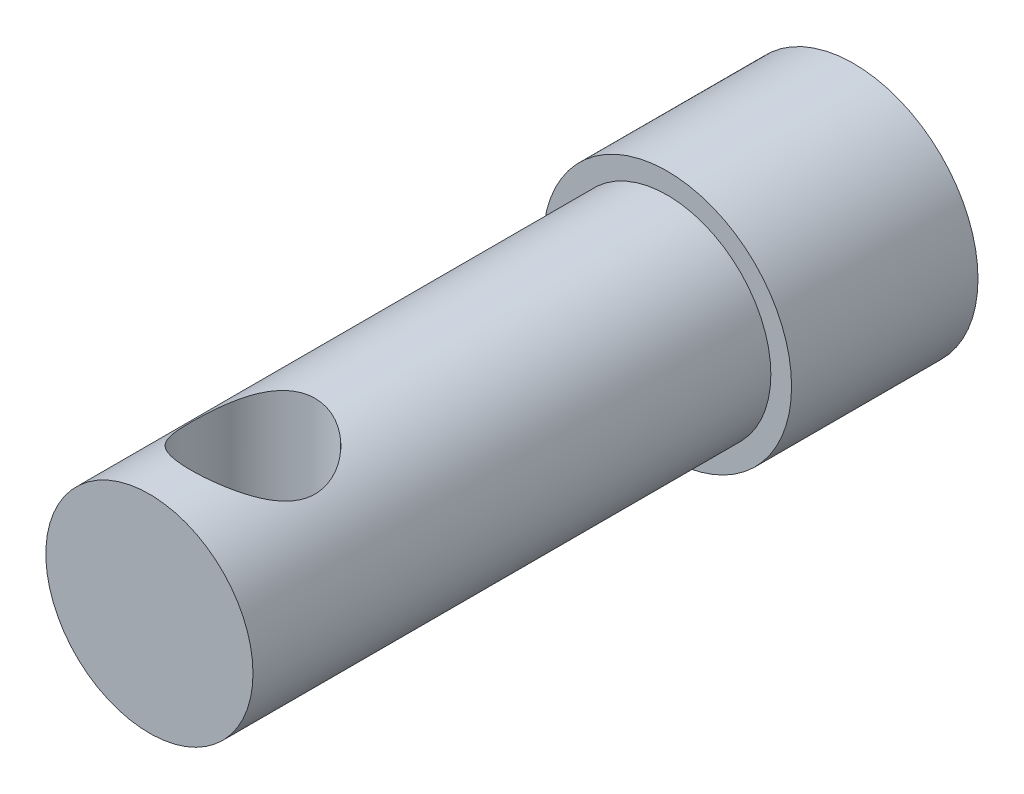
ISO-10303-21;
HEADER;
FILE_DESCRIPTION(('STEP AP214'),'2;1');
FILE_NAME('part.step','',(''),(''),'','','');
FILE_SCHEMA(('AUTOMOTIVE_DESIGN { 1 0 10303 214 1 1 1 1 }'));
ENDSEC;
DATA;
#1=APPLICATION_CONTEXT('core data for automotive mechanical design processes');
#2=APPLICATION_PROTOCOL_DEFINITION('international standard','automotive_design',2000,#1);
#3=PRODUCT_CONTEXT('',#1,'mechanical');
#4=PRODUCT('Part','Part','',(#3));
#5=PRODUCT_RELATED_PRODUCT_CATEGORY('part','',(#4));
#6=PRODUCT_DEFINITION_FORMATION('','',#4);
#7=PRODUCT_DEFINITION_CONTEXT('part definition',#1,'design');
#8=PRODUCT_DEFINITION('design','',#6,#7);
#9=PRODUCT_DEFINITION_SHAPE('','',#8);
#10=(LENGTH_UNIT() NAMED_UNIT(*) SI_UNIT(.MILLI.,.METRE.));
#11=(NAMED_UNIT(*) PLANE_ANGLE_UNIT() SI_UNIT($,.RADIAN.));
#12=(NAMED_UNIT(*) SI_UNIT($,.STERADIAN.) SOLID_ANGLE_UNIT());
#13=UNCERTAINTY_MEASURE_WITH_UNIT(LENGTH_MEASURE(1.E-05),#10,'distance_accuracy_value','');
#14=(GEOMETRIC_REPRESENTATION_CONTEXT(3) GLOBAL_UNCERTAINTY_ASSIGNED_CONTEXT((#13)) GLOBAL_UNIT_ASSIGNED_CONTEXT((#10,
#11,#12)) REPRESENTATION_CONTEXT('',''));
#15=CARTESIAN_POINT('',(0.,0.,0.));
#16=DIRECTION('',(0.,0.,1.));
#17=DIRECTION('',(1.,0.,0.));
#18=AXIS2_PLACEMENT_3D('',#15,#16,#17);
#19=CARTESIAN_POINT('',(0.,0.,34.));
#20=DIRECTION('',(0.,0.,-1.));
#21=DIRECTION('',(-1.,0.,0.));
#22=AXIS2_PLACEMENT_3D('',#19,#20,#21);
#23=CYLINDRICAL_SURFACE('',#22,5.);
#24=CARTESIAN_POINT('',(0.,5.,26.));
#25=CARTESIAN_POINT('',(0.0767697294351707,4.99999907546385,26.0000010562445));
#26=CARTESIAN_POINT('',(0.153562134518387,4.99822567812271,26.0029535935701));
#27=CARTESIAN_POINT('',(0.306548487758715,4.99118362570631,26.0147142329797));
#28=CARTESIAN_POINT('',(0.382742059346593,4.98591292553957,26.0235257611882));
#29=CARTESIAN_POINT('',(0.609808130024628,4.96499345352549,26.0586485594631));
#30=CARTESIAN_POINT('',(0.758981863291667,4.94423772571335,26.0936477024334));
#31=CARTESIAN_POINT('',(1.04754167363585,4.89123238995897,26.1847727435041));
#32=CARTESIAN_POINT('',(1.18697226741342,4.8590397955111,26.2407939220127));
#33=CARTESIAN_POINT('',(1.45405042800218,4.7859070225578,26.371720660597));
#34=CARTESIAN_POINT('',(1.58170090938261,4.74496901614699,26.4466215323602));
#35=CARTESIAN_POINT('',(1.83260160381823,4.65410731283371,26.6195496551151));
#36=CARTESIAN_POINT('',(1.95476885986166,4.60373587041895,26.7189073911665));
#37=CARTESIAN_POINT('',(2.1817645874806,4.50060875905921,26.9349344071922));
#38=CARTESIAN_POINT('',(2.28657046750404,4.4478500955754,27.0516258742183));
#39=CARTESIAN_POINT('',(2.48890019509838,4.33822134833335,27.3158470211689));
#40=CARTESIAN_POINT('',(2.5839553962784,4.28164035635797,27.4654035421222));
#41=CARTESIAN_POINT('',(2.74722868670786,4.17876602596121,27.7816931463269));
#42=CARTESIAN_POINT('',(2.8154903315581,4.13245604474886,27.9483977920332));
#43=CARTESIAN_POINT('',(2.90881204577224,4.06709259377223,28.2531929016569));
#44=CARTESIAN_POINT('',(2.94032394587637,4.04415766338645,28.3884719983614));
#45=CARTESIAN_POINT('',(2.98432344587083,4.01180616527621,28.6636074305214));
#46=CARTESIAN_POINT('',(2.99683469884359,4.00237279089368,28.803457853304));
#47=CARTESIAN_POINT('',(3.0021101681982,3.99841845126251,29.0840229926479));
#48=CARTESIAN_POINT('',(2.99483563630785,4.00392674756739,29.2247388659119));
#49=CARTESIAN_POINT('',(2.96092124146105,4.02906522155629,29.5025575351179));
#50=CARTESIAN_POINT('',(2.93426681225442,4.04870602134773,29.6396575329415));
#51=CARTESIAN_POINT('',(2.86347831933193,4.09906376582928,29.9050605422505));
#52=CARTESIAN_POINT('',(2.8195745342289,4.12963433300037,30.0334543229945));
#53=CARTESIAN_POINT('',(2.71590167467071,4.19854092703026,30.2813897666318));
#54=CARTESIAN_POINT('',(2.65612678414159,4.2368797994146,30.400928163829));
#55=CARTESIAN_POINT('',(2.5103577382067,4.32510698365561,30.6499691376563));
#56=CARTESIAN_POINT('',(2.42160671901867,4.3758426358075,30.7775599923677));
#57=CARTESIAN_POINT('',(2.22582963207776,4.4786102252415,31.0173491572201));
#58=CARTESIAN_POINT('',(2.11878609335504,4.53064336077653,31.1295325654021));
#59=CARTESIAN_POINT('',(1.87159040921357,4.63871766962913,31.3512422594485));
#60=CARTESIAN_POINT('',(1.72890315178768,4.69430681953073,31.4582193912373));
#61=CARTESIAN_POINT('',(1.50061053630278,4.77018325995047,31.5992687127229));
#62=CARTESIAN_POINT('',(1.42209821815681,4.79423315237467,31.6430641355161));
#63=CARTESIAN_POINT('',(1.26074368673913,4.83916496756429,31.723718823611));
#64=CARTESIAN_POINT('',(1.17790417501176,4.86004883588963,31.7605823520208));
#65=CARTESIAN_POINT('',(1.01376371174001,4.8968267274493,31.8248114428566));
#66=CARTESIAN_POINT('',(0.932690066663957,4.91295100454953,31.8526265604492));
#67=CARTESIAN_POINT('',(0.767879949732826,4.94139126794745,31.9013339558452));
#68=CARTESIAN_POINT('',(0.684144997174636,4.95370938553284,31.9222301084464));
#69=CARTESIAN_POINT('',(0.514744462654421,4.97416370514887,31.9567718547248));
#70=CARTESIAN_POINT('',(0.429080341969608,4.98230296820872,31.9704227558286));
#71=CARTESIAN_POINT('',(0.256621746592204,4.99415996414414,31.9902661843902));
#72=CARTESIAN_POINT('',(0.169827432617757,4.99787831889699,31.9964597608513));
#73=CARTESIAN_POINT('',(-0.067324257110645,5.00179157954795,32.0029926702836));
#74=CARTESIAN_POINT('',(-0.218056842610663,4.99746512571837,31.9958115456306));
#75=CARTESIAN_POINT('',(-0.515686907628998,4.97557955020067,31.9591544582709));
#76=CARTESIAN_POINT('',(-0.662584464852967,4.95802069684413,31.9296789476581));
#77=CARTESIAN_POINT('',(-0.945142599254814,4.91189447655688,31.8509115408157));
#78=CARTESIAN_POINT('',(-1.08098954856944,4.88360514429733,31.802118873408));
#79=CARTESIAN_POINT('',(-1.34253345184752,4.81827798628348,31.6866456757991));
#80=CARTESIAN_POINT('',(-1.46822839746276,4.78123843515362,31.6199616174059));
#81=CARTESIAN_POINT('',(-1.72001192130151,4.69690981059277,31.462885909022));
#82=CARTESIAN_POINT('',(-1.84478813824221,4.6489560240695,31.3707523061625));
#83=CARTESIAN_POINT('',(-2.07805222548222,4.54948534225871,31.1692172487452));
#84=CARTESIAN_POINT('',(-2.18652085154156,4.49796434043363,31.0597957003973));
#85=CARTESIAN_POINT('',(-2.39863988264158,4.38890846835682,30.8101792085068));
#86=CARTESIAN_POINT('',(-2.49982037884172,4.33146483230154,30.667832226057));
#87=CARTESIAN_POINT('',(-2.67690479207535,4.22432364395571,30.3655679538724));
#88=CARTESIAN_POINT('',(-2.75283533845462,4.1746179606141,30.2056694128488));
#89=CARTESIAN_POINT('',(-2.86285157351706,4.09969818429266,29.9075139548893));
#90=CARTESIAN_POINT('',(-2.90243250662613,4.07151318633887,29.772039375358));
#91=CARTESIAN_POINT('',(-2.96227327821697,4.02819211510624,29.4949358437648));
#92=CARTESIAN_POINT('',(-2.98255990395067,4.01303795327895,29.3533157105485));
#93=CARTESIAN_POINT('',(-3.00268261034206,3.99800893189922,29.0672461056048));
#94=CARTESIAN_POINT('',(-3.00244179030845,3.99819152744816,28.9227880217517));
#95=CARTESIAN_POINT('',(-2.98132945103105,4.01395435932838,28.6362111256536));
#96=CARTESIAN_POINT('',(-2.96044671369591,4.02954296823692,28.4940936281252));
#97=CARTESIAN_POINT('',(-2.90080351212233,4.07266369966216,28.2230231760049));
#98=CARTESIAN_POINT('',(-2.86295284328648,4.09958421715569,28.0937658520756));
#99=CARTESIAN_POINT('',(-2.77126473512031,4.16211005816609,27.8433254503469));
#100=CARTESIAN_POINT('',(-2.7174212751772,4.19771865147484,27.722145434387));
#101=CARTESIAN_POINT('',(-2.58578536859698,4.28025972950371,27.47136046054));
#102=CARTESIAN_POINT('',(-2.50558518231556,4.32809142579694,27.3433184917852));
#103=CARTESIAN_POINT('',(-2.32751213746958,4.42640286674054,27.1012391546934));
#104=CARTESIAN_POINT('',(-2.22962472612067,4.47688476749087,26.9872134495205));
#105=CARTESIAN_POINT('',(-2.00020353552556,4.5845123827036,26.7573011566705));
#106=CARTESIAN_POINT('',(-1.86578571790514,4.64140045738634,26.6441501201384));
#107=CARTESIAN_POINT('',(-1.57689277813436,4.74731429537958,26.4417920139519));
#108=CARTESIAN_POINT('',(-1.42241049573676,4.79633723789531,26.3525935270803));
#109=CARTESIAN_POINT('',(-1.18102189661686,4.85920558314903,26.2408755258095));
#110=CARTESIAN_POINT('',(-1.10025014285136,4.87817139185349,26.2076640040355));
#111=CARTESIAN_POINT('',(-0.935442217988387,4.91243413775203,26.1482278618565));
#112=CARTESIAN_POINT('',(-0.851407984788101,4.9277332153652,26.1219991642991));
#113=CARTESIAN_POINT('',(-0.681001816074567,4.95415527987996,26.0769905579243));
#114=CARTESIAN_POINT('',(-0.594637500609293,4.9652904423195,26.0581889226967));
#115=CARTESIAN_POINT('',(-0.420183746020764,4.98308318645253,26.028255644677));
#116=CARTESIAN_POINT('',(-0.332095806784398,4.98974449723791,26.0171176138467));
#117=CARTESIAN_POINT('',(-0.203123929661339,4.99603728421477,26.0066083161947));
#118=CARTESIAN_POINT('',(-0.16255628111349,4.99752198179196,26.004131569546));
#119=CARTESIAN_POINT('',(-0.0813278781867691,4.99950360169341,26.0008271030861));
#120=CARTESIAN_POINT('',(-0.0406671206271725,5.00000048975323,25.9999994404771));
#121=CARTESIAN_POINT('',(0.,5.,26.));
#122=B_SPLINE_CURVE_WITH_KNOTS('',3,(#24,#25,#26,#27,#28,#29,#30,#31,#32,#33,#34,#35,#36,#37,
#38,#39,#40,#41,#42,#43,#44,#45,#46,#47,#48,#49,#50,#51,#52,#53,#54,#55,#56,#57,#58,#59,#60,#61,
#62,#63,#64,#65,#66,#67,#68,#69,#70,#71,#72,#73,#74,#75,#76,#77,#78,#79,#80,#81,#82,#83,#84,#85,
#86,#87,#88,#89,#90,#91,#92,#93,#94,#95,#96,#97,#98,#99,#100,#101,#102,#103,#104,#105,#106,#107,
#108,#109,#110,#111,#112,#113,#114,#115,#116,#117,#118,#119,#120,#121),.UNSPECIFIED.,.T.,.F.,(4,
2,2,2,2,2,2,2,2,2,2,2,2,2,2,2,2,2,2,2,2,2,2,2,2,2,2,2,2,2,2,2,2,2,2,2,2,2,2,2,2,2,2,2,2,2,2,2,
4),(0.,0.230263300595003,0.4606613693334,0.922002149276126,1.38107466343613,1.84003329022065,
2.33408870888555,2.82878205293211,3.38413315803225,3.93857770807794,4.35913349134877,
4.77916531256766,5.20002031165062,5.62119195971355,6.03692224610024,6.45280509043347,
6.94139679873935,7.43045779030958,7.98767605192992,8.26653157143431,8.54521503013734,
8.80648473589063,9.06760787545943,9.32853946730961,9.58943435026958,10.0398406663534,
10.490237849174,10.9296843257003,11.3692175250854,11.8543559282721,12.3400624135416,
12.889063860465,13.437484464234,13.8674843581987,14.2968863865712,14.7278971274535,
15.1591422350194,15.5696105785277,15.9802336423656,16.4539008129506,16.927959499309,
17.4794148474152,18.0310675325446,18.2988384573895,18.5664526907294,18.8332781687618,
19.0998809626714,19.221853785686,19.3438308395353),.UNSPECIFIED.);
#123=CARTESIAN_POINT('',(0.,5.,26.));
#124=VERTEX_POINT('',#123);
#125=EDGE_CURVE('E38',#124,#124,#122,.T.);
#126=ORIENTED_EDGE('',*,*,#125,.T.);
#127=EDGE_LOOP('',(#126));
#128=FACE_BOUND('',#127,.T.);
#129=CARTESIAN_POINT('',(0.,-5.,26.));
#130=CARTESIAN_POINT('',(-0.0767697294351707,-4.99999907546385,26.0000010562445));
#131=CARTESIAN_POINT('',(-0.153562134518387,-4.99822567812271,26.0029535935701));
#132=CARTESIAN_POINT('',(-0.306548487758715,-4.99118362570631,26.0147142329797));
#133=CARTESIAN_POINT('',(-0.382742059346593,-4.98591292553957,26.0235257611882));
#134=CARTESIAN_POINT('',(-0.609808130024628,-4.96499345352549,26.0586485594631));
#135=CARTESIAN_POINT('',(-0.758981863291667,-4.94423772571335,26.0936477024334));
#136=CARTESIAN_POINT('',(-1.04754167363585,-4.89123238995897,26.1847727435041));
#137=CARTESIAN_POINT('',(-1.18697226741342,-4.8590397955111,26.2407939220127));
#138=CARTESIAN_POINT('',(-1.45405042800218,-4.7859070225578,26.371720660597));
#139=CARTESIAN_POINT('',(-1.58170090938261,-4.74496901614699,26.4466215323602));
#140=CARTESIAN_POINT('',(-1.83260160381823,-4.65410731283371,26.6195496551151));
#141=CARTESIAN_POINT('',(-1.95476885986166,-4.60373587041895,26.7189073911665));
#142=CARTESIAN_POINT('',(-2.1817645874806,-4.50060875905921,26.9349344071922));
#143=CARTESIAN_POINT('',(-2.28657046750404,-4.4478500955754,27.0516258742183));
#144=CARTESIAN_POINT('',(-2.48890019509838,-4.33822134833335,27.3158470211689));
#145=CARTESIAN_POINT('',(-2.5839553962784,-4.28164035635797,27.4654035421222));
#146=CARTESIAN_POINT('',(-2.74722868670786,-4.17876602596121,27.7816931463269));
#147=CARTESIAN_POINT('',(-2.8154903315581,-4.13245604474886,27.9483977920332));
#148=CARTESIAN_POINT('',(-2.90881204577224,-4.06709259377223,28.2531929016569));
#149=CARTESIAN_POINT('',(-2.94032394587637,-4.04415766338645,28.3884719983614));
#150=CARTESIAN_POINT('',(-2.98432344587083,-4.01180616527621,28.6636074305214));
#151=CARTESIAN_POINT('',(-2.99683469884359,-4.00237279089368,28.803457853304));
#152=CARTESIAN_POINT('',(-3.0021101681982,-3.99841845126251,29.0840229926479));
#153=CARTESIAN_POINT('',(-2.99483563630785,-4.00392674756739,29.2247388659119));
#154=CARTESIAN_POINT('',(-2.96092124146105,-4.02906522155629,29.5025575351179));
#155=CARTESIAN_POINT('',(-2.93426681225442,-4.04870602134773,29.6396575329415));
#156=CARTESIAN_POINT('',(-2.86347831933193,-4.09906376582928,29.9050605422505));
#157=CARTESIAN_POINT('',(-2.8195745342289,-4.12963433300037,30.0334543229945));
#158=CARTESIAN_POINT('',(-2.71590167467071,-4.19854092703026,30.2813897666318));
#159=CARTESIAN_POINT('',(-2.65612678414159,-4.2368797994146,30.400928163829));
#160=CARTESIAN_POINT('',(-2.5103577382067,-4.32510698365561,30.6499691376563));
#161=CARTESIAN_POINT('',(-2.42160671901867,-4.3758426358075,30.7775599923677));
#162=CARTESIAN_POINT('',(-2.22582963207776,-4.4786102252415,31.0173491572201));
#163=CARTESIAN_POINT('',(-2.11878609335504,-4.53064336077653,31.1295325654021));
#164=CARTESIAN_POINT('',(-1.87159040921357,-4.63871766962913,31.3512422594485));
#165=CARTESIAN_POINT('',(-1.72890315178768,-4.69430681953073,31.4582193912373));
#166=CARTESIAN_POINT('',(-1.50061053630278,-4.77018325995047,31.5992687127229));
#167=CARTESIAN_POINT('',(-1.42209821815681,-4.79423315237467,31.6430641355161));
#168=CARTESIAN_POINT('',(-1.26074368673913,-4.83916496756429,31.723718823611));
#169=CARTESIAN_POINT('',(-1.17790417501176,-4.86004883588963,31.7605823520208));
#170=CARTESIAN_POINT('',(-1.01376371174001,-4.8968267274493,31.8248114428566));
#171=CARTESIAN_POINT('',(-0.932690066663957,-4.91295100454953,31.8526265604492));
#172=CARTESIAN_POINT('',(-0.767879949732826,-4.94139126794745,31.9013339558452));
#173=CARTESIAN_POINT('',(-0.684144997174636,-4.95370938553284,31.9222301084464));
#174=CARTESIAN_POINT('',(-0.514744462654421,-4.97416370514887,31.9567718547248));
#175=CARTESIAN_POINT('',(-0.429080341969608,-4.98230296820872,31.9704227558286));
#176=CARTESIAN_POINT('',(-0.256621746592204,-4.99415996414414,31.9902661843902));
#177=CARTESIAN_POINT('',(-0.169827432617757,-4.99787831889699,31.9964597608513));
#178=CARTESIAN_POINT('',(0.067324257110645,-5.00179157954795,32.0029926702836));
#179=CARTESIAN_POINT('',(0.218056842610663,-4.99746512571837,31.9958115456306));
#180=CARTESIAN_POINT('',(0.515686907628998,-4.97557955020067,31.9591544582709));
#181=CARTESIAN_POINT('',(0.662584464852967,-4.95802069684413,31.9296789476581));
#182=CARTESIAN_POINT('',(0.945142599254814,-4.91189447655688,31.8509115408157));
#183=CARTESIAN_POINT('',(1.08098954856944,-4.88360514429733,31.802118873408));
#184=CARTESIAN_POINT('',(1.34253345184752,-4.81827798628348,31.6866456757991));
#185=CARTESIAN_POINT('',(1.46822839746276,-4.78123843515362,31.6199616174059));
#186=CARTESIAN_POINT('',(1.72001192130151,-4.69690981059277,31.462885909022));
#187=CARTESIAN_POINT('',(1.84478813824221,-4.6489560240695,31.3707523061625));
#188=CARTESIAN_POINT('',(2.07805222548222,-4.54948534225871,31.1692172487452));
#189=CARTESIAN_POINT('',(2.18652085154156,-4.49796434043363,31.0597957003973));
#190=CARTESIAN_POINT('',(2.39863988264158,-4.38890846835682,30.8101792085068));
#191=CARTESIAN_POINT('',(2.49982037884172,-4.33146483230154,30.667832226057));
#192=CARTESIAN_POINT('',(2.67690479207535,-4.22432364395571,30.3655679538724));
#193=CARTESIAN_POINT('',(2.75283533845462,-4.1746179606141,30.2056694128488));
#194=CARTESIAN_POINT('',(2.86285157351706,-4.09969818429266,29.9075139548893));
#195=CARTESIAN_POINT('',(2.90243250662613,-4.07151318633887,29.772039375358));
#196=CARTESIAN_POINT('',(2.96227327821697,-4.02819211510624,29.4949358437648));
#197=CARTESIAN_POINT('',(2.98255990395067,-4.01303795327895,29.3533157105485));
#198=CARTESIAN_POINT('',(3.00268261034206,-3.99800893189922,29.0672461056048));
#199=CARTESIAN_POINT('',(3.00244179030845,-3.99819152744816,28.9227880217517));
#200=CARTESIAN_POINT('',(2.98132945103105,-4.01395435932838,28.6362111256536));
#201=CARTESIAN_POINT('',(2.96044671369591,-4.02954296823692,28.4940936281252));
#202=CARTESIAN_POINT('',(2.90080351212233,-4.07266369966216,28.2230231760049));
#203=CARTESIAN_POINT('',(2.86295284328648,-4.09958421715569,28.0937658520756));
#204=CARTESIAN_POINT('',(2.77126473512031,-4.16211005816609,27.8433254503469));
#205=CARTESIAN_POINT('',(2.7174212751772,-4.19771865147484,27.722145434387));
#206=CARTESIAN_POINT('',(2.58578536859698,-4.28025972950371,27.47136046054));
#207=CARTESIAN_POINT('',(2.50558518231556,-4.32809142579694,27.3433184917852));
#208=CARTESIAN_POINT('',(2.32751213746958,-4.42640286674054,27.1012391546934));
#209=CARTESIAN_POINT('',(2.22962472612067,-4.47688476749087,26.9872134495205));
#210=CARTESIAN_POINT('',(2.00020353552556,-4.5845123827036,26.7573011566705));
#211=CARTESIAN_POINT('',(1.86578571790514,-4.64140045738634,26.6441501201384));
#212=CARTESIAN_POINT('',(1.57689277813436,-4.74731429537958,26.4417920139519));
#213=CARTESIAN_POINT('',(1.42241049573676,-4.79633723789531,26.3525935270803));
#214=CARTESIAN_POINT('',(1.18102189661686,-4.85920558314903,26.2408755258095));
#215=CARTESIAN_POINT('',(1.10025014285136,-4.87817139185349,26.2076640040355));
#216=CARTESIAN_POINT('',(0.935442217988387,-4.91243413775203,26.1482278618565));
#217=CARTESIAN_POINT('',(0.851407984788101,-4.9277332153652,26.1219991642991));
#218=CARTESIAN_POINT('',(0.681001816074567,-4.95415527987996,26.0769905579243));
#219=CARTESIAN_POINT('',(0.594637500609293,-4.9652904423195,26.0581889226967));
#220=CARTESIAN_POINT('',(0.420183746020764,-4.98308318645253,26.028255644677));
#221=CARTESIAN_POINT('',(0.332095806784398,-4.98974449723791,26.0171176138467));
#222=CARTESIAN_POINT('',(0.203123929661339,-4.99603728421477,26.0066083161947));
#223=CARTESIAN_POINT('',(0.16255628111349,-4.99752198179196,26.004131569546));
#224=CARTESIAN_POINT('',(0.0813278781867691,-4.99950360169341,26.0008271030861));
#225=CARTESIAN_POINT('',(0.0406671206271725,-5.00000048975323,25.9999994404771));
#226=CARTESIAN_POINT('',(0.,-5.,26.));
#227=B_SPLINE_CURVE_WITH_KNOTS('',3,(#129,#130,#131,#132,#133,#134,#135,#136,#137,#138,#139,
#140,#141,#142,#143,#144,#145,#146,#147,#148,#149,#150,#151,#152,#153,#154,#155,#156,#157,#158,
#159,#160,#161,#162,#163,#164,#165,#166,#167,#168,#169,#170,#171,#172,#173,#174,#175,#176,#177,
#178,#179,#180,#181,#182,#183,#184,#185,#186,#187,#188,#189,#190,#191,#192,#193,#194,#195,#196,
#197,#198,#199,#200,#201,#202,#203,#204,#205,#206,#207,#208,#209,#210,#211,#212,#213,#214,#215,
#216,#217,#218,#219,#220,#221,#222,#223,#224,#225,#226),.UNSPECIFIED.,.T.,.F.,(4,2,2,2,2,2,2,2,
2,2,2,2,2,2,2,2,2,2,2,2,2,2,2,2,2,2,2,2,2,2,2,2,2,2,2,2,2,2,2,2,2,2,2,2,2,2,2,2,4),(0.,
0.230263300595003,0.4606613693334,0.922002149276126,1.38107466343613,1.84003329022065,
2.33408870888555,2.82878205293211,3.38413315803225,3.93857770807794,4.35913349134877,
4.77916531256766,5.20002031165062,5.62119195971355,6.03692224610024,6.45280509043347,
6.94139679873935,7.43045779030958,7.98767605192992,8.26653157143431,8.54521503013734,
8.80648473589063,9.06760787545943,9.32853946730961,9.58943435026958,10.0398406663534,
10.490237849174,10.9296843257003,11.3692175250854,11.8543559282721,12.3400624135416,
12.889063860465,13.437484464234,13.8674843581987,14.2968863865712,14.7278971274535,
15.1591422350194,15.5696105785277,15.9802336423656,16.4539008129506,16.927959499309,
17.4794148474152,18.0310675325446,18.2988384573895,18.5664526907294,18.8332781687618,
19.0998809626714,19.221853785686,19.3438308395353),.UNSPECIFIED.);
#228=CARTESIAN_POINT('',(0.,-5.,26.));
#229=VERTEX_POINT('',#228);
#230=EDGE_CURVE('E11',#229,#229,#227,.T.);
#231=ORIENTED_EDGE('',*,*,#230,.T.);
#232=EDGE_LOOP('',(#231));
#233=FACE_BOUND('',#232,.T.);
#234=CARTESIAN_POINT('',(0.,0.,9.));
#235=DIRECTION('',(0.,0.,1.));
#236=DIRECTION('',(1.,0.,0.));
#237=AXIS2_PLACEMENT_3D('',#234,#235,#236);
#238=CIRCLE('',#237,5.);
#239=CARTESIAN_POINT('',(5.,0.,9.));
#240=VERTEX_POINT('',#239);
#241=EDGE_CURVE('E171',#240,#240,#238,.T.);
#242=ORIENTED_EDGE('',*,*,#241,.T.);
#243=EDGE_LOOP('',(#242));
#244=FACE_BOUND('',#243,.T.);
#245=CARTESIAN_POINT('',(0.,0.,34.));
#246=DIRECTION('',(0.,0.,1.));
#247=DIRECTION('',(1.,0.,0.));
#248=AXIS2_PLACEMENT_3D('',#245,#246,#247);
#249=CIRCLE('',#248,5.);
#250=CARTESIAN_POINT('',(5.,0.,34.));
#251=VERTEX_POINT('',#250);
#252=EDGE_CURVE('E46',#251,#251,#249,.T.);
#253=ORIENTED_EDGE('',*,*,#252,.F.);
#254=EDGE_LOOP('',(#253));
#255=FACE_BOUND('',#254,.T.);
#256=ADVANCED_FACE('F34',(#128,#233,#244,#255),#23,.T.);
#257=CARTESIAN_POINT('',(0.,0.,34.));
#258=DIRECTION('',(0.,0.,1.));
#259=DIRECTION('',(1.,0.,0.));
#260=AXIS2_PLACEMENT_3D('',#257,#258,#259);
#261=PLANE('',#260);
#262=ORIENTED_EDGE('',*,*,#252,.T.);
#263=EDGE_LOOP('',(#262));
#264=FACE_BOUND('',#263,.T.);
#265=ADVANCED_FACE('F218',(#264),#261,.T.);
#266=CARTESIAN_POINT('',(0.,0.,9.));
#267=DIRECTION('',(0.,0.,1.));
#268=DIRECTION('',(1.,0.,0.));
#269=AXIS2_PLACEMENT_3D('',#266,#267,#268);
#270=PLANE('',#269);
#271=CARTESIAN_POINT('',(0.,0.,9.));
#272=DIRECTION('',(0.,0.,1.));
#273=DIRECTION('',(1.,0.,0.));
#274=AXIS2_PLACEMENT_3D('',#271,#272,#273);
#275=CIRCLE('',#274,6.);
#276=CARTESIAN_POINT('',(6.,0.,9.));
#277=VERTEX_POINT('',#276);
#278=EDGE_CURVE('E168',#277,#277,#275,.T.);
#279=ORIENTED_EDGE('',*,*,#278,.T.);
#280=EDGE_LOOP('',(#279));
#281=FACE_BOUND('',#280,.T.);
#282=ORIENTED_EDGE('',*,*,#241,.F.);
#283=EDGE_LOOP('',(#282));
#284=FACE_BOUND('',#283,.T.);
#285=ADVANCED_FACE('F214',(#281,#284),#270,.T.);
#286=CARTESIAN_POINT('',(0.,0.,9.));
#287=DIRECTION('',(0.,0.,-1.));
#288=DIRECTION('',(-1.,0.,0.));
#289=AXIS2_PLACEMENT_3D('',#286,#287,#288);
#290=CYLINDRICAL_SURFACE('',#289,6.);
#291=ORIENTED_EDGE('',*,*,#278,.F.);
#292=EDGE_LOOP('',(#291));
#293=FACE_BOUND('',#292,.T.);
#294=CARTESIAN_POINT('',(0.,0.,0.));
#295=DIRECTION('',(0.,0.,1.));
#296=DIRECTION('',(1.,0.,0.));
#297=AXIS2_PLACEMENT_3D('',#294,#295,#296);
#298=CIRCLE('',#297,6.);
#299=CARTESIAN_POINT('',(6.,0.,0.));
#300=VERTEX_POINT('',#299);
#301=EDGE_CURVE('E158',#300,#300,#298,.T.);
#302=ORIENTED_EDGE('',*,*,#301,.T.);
#303=EDGE_LOOP('',(#302));
#304=FACE_BOUND('',#303,.T.);
#305=ADVANCED_FACE('F217',(#293,#304),#290,.T.);
#306=CARTESIAN_POINT('',(0.,0.,0.));
#307=DIRECTION('',(0.,0.,1.));
#308=DIRECTION('',(1.,0.,0.));
#309=AXIS2_PLACEMENT_3D('',#306,#307,#308);
#310=PLANE('',#309);
#311=DIRECTION('',(0.,1.,0.));
#312=VECTOR('',#311,1.);
#313=CARTESIAN_POINT('',(-3.165,-2.565,0.));
#314=LINE('',#313,#312);
#315=CARTESIAN_POINT('',(-3.165,-2.565,0.));
#316=VERTEX_POINT('',#315);
#317=CARTESIAN_POINT('',(-3.165,2.565,0.));
#318=VERTEX_POINT('',#317);
#319=EDGE_CURVE('E139',#316,#318,#314,.T.);
#320=ORIENTED_EDGE('',*,*,#319,.F.);
#321=CARTESIAN_POINT('',(-2.565,-2.565,0.));
#322=DIRECTION('',(0.,0.,-1.));
#323=DIRECTION('',(-1.,0.,0.));
#324=AXIS2_PLACEMENT_3D('',#321,#322,#323);
#325=CIRCLE('',#324,0.6);
#326=CARTESIAN_POINT('',(-2.565,-3.165,0.));
#327=VERTEX_POINT('',#326);
#328=EDGE_CURVE('E53',#327,#316,#325,.T.);
#329=ORIENTED_EDGE('',*,*,#328,.F.);
#330=DIRECTION('',(-1.,0.,0.));
#331=VECTOR('',#330,1.);
#332=CARTESIAN_POINT('',(-2.565,-3.165,0.));
#333=LINE('',#332,#331);
#334=CARTESIAN_POINT('',(2.565,-3.165,0.));
#335=VERTEX_POINT('',#334);
#336=EDGE_CURVE('E154',#335,#327,#333,.T.);
#337=ORIENTED_EDGE('',*,*,#336,.F.);
#338=CARTESIAN_POINT('',(2.565,-2.565,0.));
#339=DIRECTION('',(0.,0.,-1.));
#340=DIRECTION('',(1.,0.,0.));
#341=AXIS2_PLACEMENT_3D('',#338,#339,#340);
#342=CIRCLE('',#341,0.6);
#343=CARTESIAN_POINT('',(3.165,-2.565,0.));
#344=VERTEX_POINT('',#343);
#345=EDGE_CURVE('E152',#344,#335,#342,.T.);
#346=ORIENTED_EDGE('',*,*,#345,.F.);
#347=DIRECTION('',(0.,-1.,0.));
#348=VECTOR('',#347,1.);
#349=CARTESIAN_POINT('',(3.165,-2.565,0.));
#350=LINE('',#349,#348);
#351=CARTESIAN_POINT('',(3.165,2.56499999999999,0.));
#352=VERTEX_POINT('',#351);
#353=EDGE_CURVE('E113',#352,#344,#350,.T.);
#354=ORIENTED_EDGE('',*,*,#353,.F.);
#355=CARTESIAN_POINT('',(2.565,2.565,0.));
#356=DIRECTION('',(0.,0.,-1.));
#357=DIRECTION('',(-1.,0.,0.));
#358=AXIS2_PLACEMENT_3D('',#355,#356,#357);
#359=CIRCLE('',#358,0.6);
#360=CARTESIAN_POINT('',(2.565,3.165,0.));
#361=VERTEX_POINT('',#360);
#362=EDGE_CURVE('E148',#361,#352,#359,.T.);
#363=ORIENTED_EDGE('',*,*,#362,.F.);
#364=DIRECTION('',(1.,0.,0.));
#365=VECTOR('',#364,1.);
#366=CARTESIAN_POINT('',(-2.565,3.165,0.));
#367=LINE('',#366,#365);
#368=CARTESIAN_POINT('',(-2.565,3.165,0.));
#369=VERTEX_POINT('',#368);
#370=EDGE_CURVE('E145',#369,#361,#367,.T.);
#371=ORIENTED_EDGE('',*,*,#370,.F.);
#372=CARTESIAN_POINT('',(-2.565,2.565,0.));
#373=DIRECTION('',(0.,0.,-1.));
#374=DIRECTION('',(-1.,0.,0.));
#375=AXIS2_PLACEMENT_3D('',#372,#373,#374);
#376=CIRCLE('',#375,0.6);
#377=EDGE_CURVE('E142',#318,#369,#376,.T.);
#378=ORIENTED_EDGE('',*,*,#377,.F.);
#379=EDGE_LOOP('',(#320,#329,#337,#346,#354,#363,#371,#378));
#380=FACE_BOUND('',#379,.T.);
#381=ORIENTED_EDGE('',*,*,#301,.F.);
#382=EDGE_LOOP('',(#381));
#383=FACE_BOUND('',#382,.T.);
#384=ADVANCED_FACE('F213',(#380,#383),#310,.F.);
#385=CARTESIAN_POINT('',(-2.565,-2.565,8.));
#386=DIRECTION('',(0.,0.,-1.));
#387=DIRECTION('',(-1.,0.,0.));
#388=AXIS2_PLACEMENT_3D('',#385,#386,#387);
#389=CYLINDRICAL_SURFACE('',#388,0.6);
#390=ORIENTED_EDGE('',*,*,#328,.T.);
#391=DIRECTION('',(0.,0.,-1.));
#392=VECTOR('',#391,1.);
#393=CARTESIAN_POINT('',(-3.165,-2.565,8.));
#394=LINE('',#393,#392);
#395=CARTESIAN_POINT('',(-3.165,-2.565,8.));
#396=VERTEX_POINT('',#395);
#397=EDGE_CURVE('E89',#396,#316,#394,.T.);
#398=ORIENTED_EDGE('',*,*,#397,.F.);
#399=CARTESIAN_POINT('',(-2.565,-2.565,8.));
#400=DIRECTION('',(0.,0.,-1.));
#401=DIRECTION('',(-1.,0.,0.));
#402=AXIS2_PLACEMENT_3D('',#399,#400,#401);
#403=CIRCLE('',#402,0.6);
#404=CARTESIAN_POINT('',(-2.565,-3.165,8.));
#405=VERTEX_POINT('',#404);
#406=EDGE_CURVE('E156',#405,#396,#403,.T.);
#407=ORIENTED_EDGE('',*,*,#406,.F.);
#408=DIRECTION('',(0.,0.,-1.));
#409=VECTOR('',#408,1.);
#410=CARTESIAN_POINT('',(-2.565,-3.165,8.));
#411=LINE('',#410,#409);
#412=EDGE_CURVE('E61',#405,#327,#411,.T.);
#413=ORIENTED_EDGE('',*,*,#412,.T.);
#414=EDGE_LOOP('',(#390,#398,#407,#413));
#415=FACE_BOUND('',#414,.T.);
#416=ADVANCED_FACE('F191',(#415),#389,.F.);
#417=CARTESIAN_POINT('',(-2.565,-3.165,8.));
#418=DIRECTION('',(0.,-1.,0.));
#419=DIRECTION('',(1.,0.,0.));
#420=AXIS2_PLACEMENT_3D('',#417,#418,#419);
#421=PLANE('',#420);
#422=ORIENTED_EDGE('',*,*,#336,.T.);
#423=ORIENTED_EDGE('',*,*,#412,.F.);
#424=DIRECTION('',(-1.,0.,0.));
#425=VECTOR('',#424,1.);
#426=CARTESIAN_POINT('',(-2.565,-3.165,8.));
#427=LINE('',#426,#425);
#428=CARTESIAN_POINT('',(2.565,-3.165,8.));
#429=VERTEX_POINT('',#428);
#430=EDGE_CURVE('E125',#429,#405,#427,.T.);
#431=ORIENTED_EDGE('',*,*,#430,.F.);
#432=DIRECTION('',(0.,0.,-1.));
#433=VECTOR('',#432,1.);
#434=CARTESIAN_POINT('',(2.565,-3.165,8.));
#435=LINE('',#434,#433);
#436=EDGE_CURVE('E117',#429,#335,#435,.T.);
#437=ORIENTED_EDGE('',*,*,#436,.T.);
#438=EDGE_LOOP('',(#422,#423,#431,#437));
#439=FACE_BOUND('',#438,.T.);
#440=ADVANCED_FACE('F188',(#439),#421,.F.);
#441=CARTESIAN_POINT('',(2.565,-2.565,8.));
#442=DIRECTION('',(0.,0.,-1.));
#443=DIRECTION('',(-1.,0.,0.));
#444=AXIS2_PLACEMENT_3D('',#441,#442,#443);
#445=CYLINDRICAL_SURFACE('',#444,0.6);
#446=ORIENTED_EDGE('',*,*,#345,.T.);
#447=ORIENTED_EDGE('',*,*,#436,.F.);
#448=CARTESIAN_POINT('',(2.565,-2.565,8.));
#449=DIRECTION('',(0.,0.,-1.));
#450=DIRECTION('',(1.,0.,0.));
#451=AXIS2_PLACEMENT_3D('',#448,#449,#450);
#452=CIRCLE('',#451,0.6);
#453=CARTESIAN_POINT('',(3.165,-2.565,8.));
#454=VERTEX_POINT('',#453);
#455=EDGE_CURVE('E121',#454,#429,#452,.T.);
#456=ORIENTED_EDGE('',*,*,#455,.F.);
#457=DIRECTION('',(0.,0.,-1.));
#458=VECTOR('',#457,1.);
#459=CARTESIAN_POINT('',(3.165,-2.565,8.));
#460=LINE('',#459,#458);
#461=EDGE_CURVE('E106',#454,#344,#460,.T.);
#462=ORIENTED_EDGE('',*,*,#461,.T.);
#463=EDGE_LOOP('',(#446,#447,#456,#462));
#464=FACE_BOUND('',#463,.T.);
#465=ADVANCED_FACE('F122',(#464),#445,.F.);
#466=CARTESIAN_POINT('',(3.165,-2.565,8.));
#467=DIRECTION('',(1.,0.,0.));
#468=DIRECTION('',(0.,0.,-1.));
#469=AXIS2_PLACEMENT_3D('',#466,#467,#468);
#470=PLANE('',#469);
#471=ORIENTED_EDGE('',*,*,#353,.T.);
#472=ORIENTED_EDGE('',*,*,#461,.F.);
#473=DIRECTION('',(0.,-1.,0.));
#474=VECTOR('',#473,1.);
#475=CARTESIAN_POINT('',(3.165,-2.565,8.));
#476=LINE('',#475,#474);
#477=CARTESIAN_POINT('',(3.165,2.56499999999999,8.));
#478=VERTEX_POINT('',#477);
#479=EDGE_CURVE('E110',#478,#454,#476,.T.);
#480=ORIENTED_EDGE('',*,*,#479,.F.);
#481=DIRECTION('',(0.,0.,-1.));
#482=VECTOR('',#481,1.);
#483=CARTESIAN_POINT('',(3.165,2.56499999999999,8.));
#484=LINE('',#483,#482);
#485=EDGE_CURVE('E118',#478,#352,#484,.T.);
#486=ORIENTED_EDGE('',*,*,#485,.T.);
#487=EDGE_LOOP('',(#471,#472,#480,#486));
#488=FACE_BOUND('',#487,.T.);
#489=ADVANCED_FACE('F108',(#488),#470,.F.);
#490=CARTESIAN_POINT('',(2.565,2.565,8.));
#491=DIRECTION('',(0.,0.,-1.));
#492=DIRECTION('',(-1.,0.,0.));
#493=AXIS2_PLACEMENT_3D('',#490,#491,#492);
#494=CYLINDRICAL_SURFACE('',#493,0.6);
#495=ORIENTED_EDGE('',*,*,#362,.T.);
#496=ORIENTED_EDGE('',*,*,#485,.F.);
#497=CARTESIAN_POINT('',(2.565,2.565,8.));
#498=DIRECTION('',(0.,0.,-1.));
#499=DIRECTION('',(-1.,0.,0.));
#500=AXIS2_PLACEMENT_3D('',#497,#498,#499);
#501=CIRCLE('',#500,0.6);
#502=CARTESIAN_POINT('',(2.565,3.165,8.));
#503=VERTEX_POINT('',#502);
#504=EDGE_CURVE('E131',#503,#478,#501,.T.);
#505=ORIENTED_EDGE('',*,*,#504,.F.);
#506=DIRECTION('',(0.,0.,-1.));
#507=VECTOR('',#506,1.);
#508=CARTESIAN_POINT('',(2.565,3.165,8.));
#509=LINE('',#508,#507);
#510=EDGE_CURVE('E161',#503,#361,#509,.T.);
#511=ORIENTED_EDGE('',*,*,#510,.T.);
#512=EDGE_LOOP('',(#495,#496,#505,#511));
#513=FACE_BOUND('',#512,.T.);
#514=ADVANCED_FACE('F196',(#513),#494,.F.);
#515=CARTESIAN_POINT('',(-2.565,3.165,8.));
#516=DIRECTION('',(0.,1.,0.));
#517=DIRECTION('',(-1.,0.,0.));
#518=AXIS2_PLACEMENT_3D('',#515,#516,#517);
#519=PLANE('',#518);
#520=ORIENTED_EDGE('',*,*,#370,.T.);
#521=ORIENTED_EDGE('',*,*,#510,.F.);
#522=DIRECTION('',(1.,0.,0.));
#523=VECTOR('',#522,1.);
#524=CARTESIAN_POINT('',(-2.565,3.165,8.));
#525=LINE('',#524,#523);
#526=CARTESIAN_POINT('',(-2.565,3.165,8.));
#527=VERTEX_POINT('',#526);
#528=EDGE_CURVE('E133',#527,#503,#525,.T.);
#529=ORIENTED_EDGE('',*,*,#528,.F.);
#530=DIRECTION('',(0.,0.,-1.));
#531=VECTOR('',#530,1.);
#532=CARTESIAN_POINT('',(-2.565,3.165,8.));
#533=LINE('',#532,#531);
#534=EDGE_CURVE('E163',#527,#369,#533,.T.);
#535=ORIENTED_EDGE('',*,*,#534,.T.);
#536=EDGE_LOOP('',(#520,#521,#529,#535));
#537=FACE_BOUND('',#536,.T.);
#538=ADVANCED_FACE('F199',(#537),#519,.F.);
#539=CARTESIAN_POINT('',(-2.565,2.565,8.));
#540=DIRECTION('',(0.,0.,-1.));
#541=DIRECTION('',(-1.,0.,0.));
#542=AXIS2_PLACEMENT_3D('',#539,#540,#541);
#543=CYLINDRICAL_SURFACE('',#542,0.6);
#544=ORIENTED_EDGE('',*,*,#377,.T.);
#545=ORIENTED_EDGE('',*,*,#534,.F.);
#546=CARTESIAN_POINT('',(-2.565,2.565,8.));
#547=DIRECTION('',(0.,0.,-1.));
#548=DIRECTION('',(-1.,0.,0.));
#549=AXIS2_PLACEMENT_3D('',#546,#547,#548);
#550=CIRCLE('',#549,0.6);
#551=CARTESIAN_POINT('',(-3.165,2.565,8.));
#552=VERTEX_POINT('',#551);
#553=EDGE_CURVE('E343',#552,#527,#550,.T.);
#554=ORIENTED_EDGE('',*,*,#553,.F.);
#555=DIRECTION('',(0.,0.,-1.));
#556=VECTOR('',#555,1.);
#557=CARTESIAN_POINT('',(-3.165,2.565,8.));
#558=LINE('',#557,#556);
#559=EDGE_CURVE('E165',#552,#318,#558,.T.);
#560=ORIENTED_EDGE('',*,*,#559,.T.);
#561=EDGE_LOOP('',(#544,#545,#554,#560));
#562=FACE_BOUND('',#561,.T.);
#563=ADVANCED_FACE('F203',(#562),#543,.F.);
#564=CARTESIAN_POINT('',(-3.165,-2.565,8.));
#565=DIRECTION('',(-1.,0.,0.));
#566=DIRECTION('',(0.,0.,1.));
#567=AXIS2_PLACEMENT_3D('',#564,#565,#566);
#568=PLANE('',#567);
#569=ORIENTED_EDGE('',*,*,#319,.T.);
#570=ORIENTED_EDGE('',*,*,#559,.F.);
#571=DIRECTION('',(0.,1.,0.));
#572=VECTOR('',#571,1.);
#573=CARTESIAN_POINT('',(-3.165,-2.565,8.));
#574=LINE('',#573,#572);
#575=EDGE_CURVE('E341',#396,#552,#574,.T.);
#576=ORIENTED_EDGE('',*,*,#575,.F.);
#577=ORIENTED_EDGE('',*,*,#397,.T.);
#578=EDGE_LOOP('',(#569,#570,#576,#577));
#579=FACE_BOUND('',#578,.T.);
#580=ADVANCED_FACE('F187',(#579),#568,.F.);
#581=CARTESIAN_POINT('',(-2.565,-2.565,8.));
#582=DIRECTION('',(0.,0.,-1.));
#583=DIRECTION('',(-1.,0.,0.));
#584=AXIS2_PLACEMENT_3D('',#581,#582,#583);
#585=PLANE('',#584);
#586=ORIENTED_EDGE('',*,*,#406,.T.);
#587=ORIENTED_EDGE('',*,*,#575,.T.);
#588=ORIENTED_EDGE('',*,*,#553,.T.);
#589=ORIENTED_EDGE('',*,*,#528,.T.);
#590=ORIENTED_EDGE('',*,*,#504,.T.);
#591=ORIENTED_EDGE('',*,*,#479,.T.);
#592=ORIENTED_EDGE('',*,*,#455,.T.);
#593=ORIENTED_EDGE('',*,*,#430,.T.);
#594=EDGE_LOOP('',(#586,#587,#588,#589,#590,#591,#592,#593));
#595=FACE_BOUND('',#594,.T.);
#596=ADVANCED_FACE('F128',(#595),#585,.T.);
#597=CARTESIAN_POINT('',(0.,6.,29.));
#598=DIRECTION('',(0.,-1.,0.));
#599=DIRECTION('',(0.,0.,-1.));
#600=AXIS2_PLACEMENT_3D('',#597,#598,#599);
#601=CYLINDRICAL_SURFACE('',#600,3.);
#602=ORIENTED_EDGE('',*,*,#125,.F.);
#603=EDGE_LOOP('',(#602));
#604=FACE_BOUND('',#603,.T.);
#605=ORIENTED_EDGE('',*,*,#230,.F.);
#606=EDGE_LOOP('',(#605));
#607=FACE_BOUND('',#606,.T.);
#608=ADVANCED_FACE('F179',(#604,#607),#601,.F.);
#609=CLOSED_SHELL('',(#256,#265,#285,#305,#384,#416,#440,#465,#489,#514,#538,#563,#580,#596,#608));
#610=MANIFOLD_SOLID_BREP('B2',#609);
#611=ADVANCED_BREP_SHAPE_REPRESENTATION('',(#18,#610),#14);
#612=SHAPE_DEFINITION_REPRESENTATION(#9,#611);
ENDSEC;
END-ISO-10303-21;
